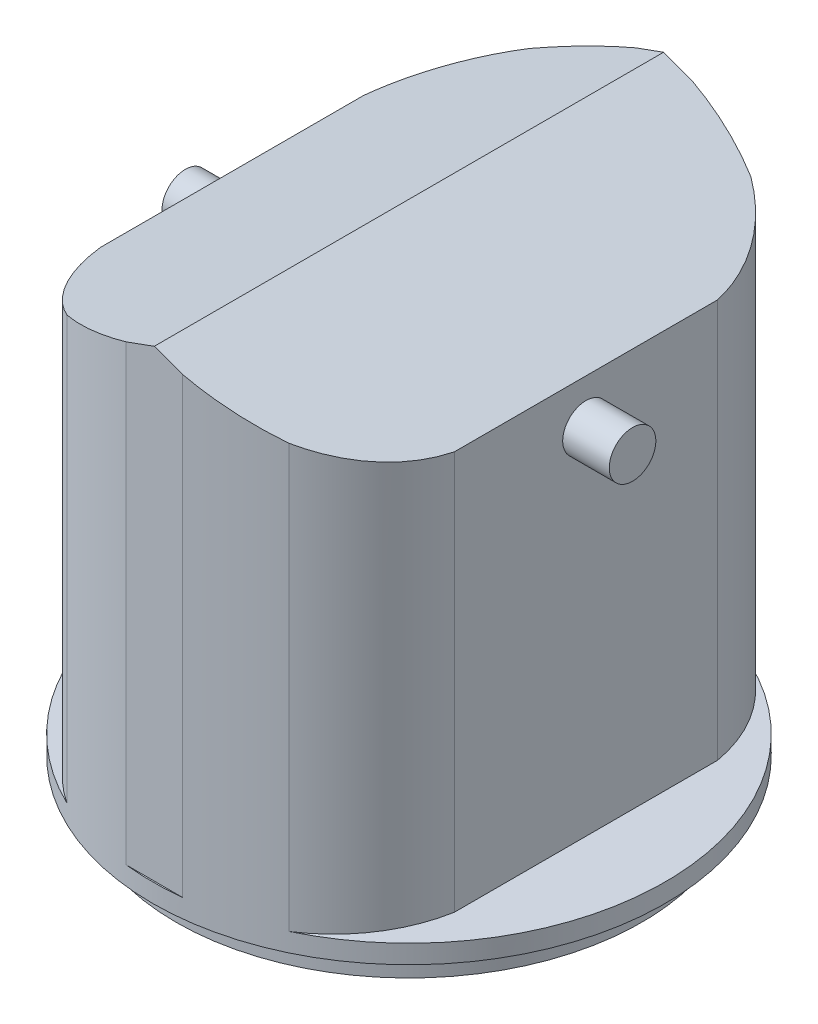
ISO-10303-21;
HEADER;
FILE_DESCRIPTION(('STEP AP214'),'2;1');
FILE_NAME('part.step','',(''),(''),'','','');
FILE_SCHEMA(('AUTOMOTIVE_DESIGN { 1 0 10303 214 1 1 1 1 }'));
ENDSEC;
DATA;
#1=APPLICATION_CONTEXT('core data for automotive mechanical design processes');
#2=APPLICATION_PROTOCOL_DEFINITION('international standard','automotive_design',2000,#1);
#3=PRODUCT_CONTEXT('',#1,'mechanical');
#4=PRODUCT('Part','Part','',(#3));
#5=PRODUCT_RELATED_PRODUCT_CATEGORY('part','',(#4));
#6=PRODUCT_DEFINITION_FORMATION('','',#4);
#7=PRODUCT_DEFINITION_CONTEXT('part definition',#1,'design');
#8=PRODUCT_DEFINITION('design','',#6,#7);
#9=PRODUCT_DEFINITION_SHAPE('','',#8);
#10=(LENGTH_UNIT() NAMED_UNIT(*) SI_UNIT(.MILLI.,.METRE.));
#11=(NAMED_UNIT(*) PLANE_ANGLE_UNIT() SI_UNIT($,.RADIAN.));
#12=(NAMED_UNIT(*) SI_UNIT($,.STERADIAN.) SOLID_ANGLE_UNIT());
#13=UNCERTAINTY_MEASURE_WITH_UNIT(LENGTH_MEASURE(1.E-05),#10,'distance_accuracy_value','');
#14=(GEOMETRIC_REPRESENTATION_CONTEXT(3) GLOBAL_UNCERTAINTY_ASSIGNED_CONTEXT((#13)) GLOBAL_UNIT_ASSIGNED_CONTEXT((#10,
#11,#12)) REPRESENTATION_CONTEXT('',''));
#15=CARTESIAN_POINT('',(0.,0.,0.));
#16=DIRECTION('',(0.,0.,1.));
#17=DIRECTION('',(1.,0.,0.));
#18=AXIS2_PLACEMENT_3D('',#15,#16,#17);
#19=CARTESIAN_POINT('',(0.,2.,0.));
#20=DIRECTION('',(0.,1.,0.));
#21=DIRECTION('',(0.,0.,1.));
#22=AXIS2_PLACEMENT_3D('',#19,#20,#21);
#23=PLANE('',#22);
#24=CARTESIAN_POINT('',(0.,2.,0.));
#25=DIRECTION('',(0.,1.,0.));
#26=DIRECTION('',(0.,0.,1.));
#27=AXIS2_PLACEMENT_3D('',#24,#25,#26);
#28=CIRCLE('',#27,27.5);
#29=CARTESIAN_POINT('',(-11.9035987749492,2.,-24.790206457491));
#30=VERTEX_POINT('',#29);
#31=CARTESIAN_POINT('',(-11.9035987749492,2.,24.790206457491));
#32=VERTEX_POINT('',#31);
#33=EDGE_CURVE('E146',#30,#32,#28,.T.);
#34=ORIENTED_EDGE('',*,*,#33,.T.);
#35=CARTESIAN_POINT('',(-3.24629308527923,2.,11.3346849813234));
#36=DIRECTION('',(0.,1.,0.));
#37=DIRECTION('',(0.,0.,1.));
#38=AXIS2_PLACEMENT_3D('',#35,#36,#37);
#39=CIRCLE('',#38,16.);
#40=CARTESIAN_POINT('',(-19.,2.,14.1312397269128));
#41=VERTEX_POINT('',#40);
#42=EDGE_CURVE('E155',#32,#41,#39,.F.);
#43=ORIENTED_EDGE('',*,*,#42,.T.);
#44=DIRECTION('',(0.,0.,1.));
#45=VECTOR('',#44,1.);
#46=CARTESIAN_POINT('',(-19.,2.,0.));
#47=LINE('',#46,#45);
#48=CARTESIAN_POINT('',(-19.,2.,-14.1312397269127));
#49=VERTEX_POINT('',#48);
#50=EDGE_CURVE('E242',#49,#41,#47,.T.);
#51=ORIENTED_EDGE('',*,*,#50,.F.);
#52=CARTESIAN_POINT('',(-3.24629308527922,2.,-11.3346849813234));
#53=DIRECTION('',(0.,1.,0.));
#54=DIRECTION('',(0.,0.,1.));
#55=AXIS2_PLACEMENT_3D('',#52,#53,#54);
#56=CIRCLE('',#55,16.);
#57=EDGE_CURVE('E167',#30,#49,#56,.T.);
#58=ORIENTED_EDGE('',*,*,#57,.F.);
#59=EDGE_LOOP('',(#34,#43,#51,#58));
#60=FACE_BOUND('',#59,.T.);
#61=ADVANCED_FACE('F43',(#60),#23,.T.);
#62=CARTESIAN_POINT('',(11.9035987749491,2.,24.7902064574911));
#63=VERTEX_POINT('',#62);
#64=CARTESIAN_POINT('',(11.9035987749492,2.,-24.790206457491));
#65=VERTEX_POINT('',#64);
#66=EDGE_CURVE('E175',#63,#65,#28,.T.);
#67=ORIENTED_EDGE('',*,*,#66,.T.);
#68=CARTESIAN_POINT('',(3.24629308527922,2.,-11.3346849813234));
#69=DIRECTION('',(0.,1.,0.));
#70=DIRECTION('',(0.,0.,1.));
#71=AXIS2_PLACEMENT_3D('',#68,#69,#70);
#72=CIRCLE('',#71,16.);
#73=CARTESIAN_POINT('',(19.,2.,-14.1312397269127));
#74=VERTEX_POINT('',#73);
#75=EDGE_CURVE('E349',#65,#74,#72,.F.);
#76=ORIENTED_EDGE('',*,*,#75,.T.);
#77=DIRECTION('',(0.,0.,1.));
#78=VECTOR('',#77,1.);
#79=CARTESIAN_POINT('',(19.,2.,0.));
#80=LINE('',#79,#78);
#81=CARTESIAN_POINT('',(19.,2.,14.1312397269126));
#82=VERTEX_POINT('',#81);
#83=EDGE_CURVE('E342',#74,#82,#80,.T.);
#84=ORIENTED_EDGE('',*,*,#83,.T.);
#85=CARTESIAN_POINT('',(3.24629308527921,2.,11.3346849813234));
#86=DIRECTION('',(0.,1.,0.));
#87=DIRECTION('',(0.,0.,1.));
#88=AXIS2_PLACEMENT_3D('',#85,#86,#87);
#89=CIRCLE('',#88,16.);
#90=EDGE_CURVE('E338',#63,#82,#89,.T.);
#91=ORIENTED_EDGE('',*,*,#90,.F.);
#92=EDGE_LOOP('',(#67,#76,#84,#91));
#93=FACE_BOUND('',#92,.T.);
#94=ADVANCED_FACE('F308',(#93),#23,.T.);
#95=CARTESIAN_POINT('',(-3.01081334058014,2.,27.3346849813234));
#96=VERTEX_POINT('',#95);
#97=CARTESIAN_POINT('',(3.01081334058014,2.,27.3346849813234));
#98=VERTEX_POINT('',#97);
#99=EDGE_CURVE('E170',#96,#98,#28,.T.);
#100=ORIENTED_EDGE('',*,*,#99,.T.);
#101=DIRECTION('',(-1.,0.,0.));
#102=VECTOR('',#101,1.);
#103=CARTESIAN_POINT('',(0.,2.,27.3346849813234));
#104=LINE('',#103,#102);
#105=EDGE_CURVE('E162',#98,#96,#104,.T.);
#106=ORIENTED_EDGE('',*,*,#105,.T.);
#107=EDGE_LOOP('',(#100,#106));
#108=FACE_BOUND('',#107,.T.);
#109=ADVANCED_FACE('F314',(#108),#23,.T.);
#110=CARTESIAN_POINT('',(0.,2.,0.));
#111=DIRECTION('',(0.,-1.,0.));
#112=DIRECTION('',(0.,0.,-1.));
#113=AXIS2_PLACEMENT_3D('',#110,#111,#112);
#114=CYLINDRICAL_SURFACE('',#113,27.5);
#115=DIRECTION('',(0.,-1.,0.));
#116=VECTOR('',#115,1.);
#117=CARTESIAN_POINT('',(11.9035987749491,52.8,24.7902064574911));
#118=LINE('',#117,#116);
#119=CARTESIAN_POINT('',(11.9035987749491,47.3828788163288,24.7902064574911));
#120=VERTEX_POINT('',#119);
#121=EDGE_CURVE('E274',#120,#63,#118,.T.);
#122=ORIENTED_EDGE('',*,*,#121,.F.);
#123=CARTESIAN_POINT('',(0.,51.7154344510578,0.));
#124=DIRECTION('',(-0.342020143325669,-0.939692620785908,0.));
#125=DIRECTION('',(0.939692620785908,-0.342020143325669,0.));
#126=AXIS2_PLACEMENT_3D('',#123,#124,#125);
#127=ELLIPSE('',#126,29.2648887430876,27.5);
#128=CARTESIAN_POINT('',(3.01081334058014,50.6195880141551,27.3346849813234));
#129=VERTEX_POINT('',#128);
#130=EDGE_CURVE('E204',#120,#129,#127,.T.);
#131=ORIENTED_EDGE('',*,*,#130,.T.);
#132=DIRECTION('',(0.,-1.,0.));
#133=VECTOR('',#132,1.);
#134=CARTESIAN_POINT('',(3.01081334058014,52.8,27.3346849813234));
#135=LINE('',#134,#133);
#136=EDGE_CURVE('E277',#129,#98,#135,.T.);
#137=ORIENTED_EDGE('',*,*,#136,.T.);
#138=ORIENTED_EDGE('',*,*,#99,.F.);
#139=DIRECTION('',(0.,-1.,0.));
#140=VECTOR('',#139,1.);
#141=CARTESIAN_POINT('',(-3.01081334058014,52.8,27.3346849813234));
#142=LINE('',#141,#140);
#143=CARTESIAN_POINT('',(-3.01081334058014,50.6195880141551,27.3346849813234));
#144=VERTEX_POINT('',#143);
#145=EDGE_CURVE('E152',#144,#96,#142,.T.);
#146=ORIENTED_EDGE('',*,*,#145,.F.);
#147=CARTESIAN_POINT('',(0.,51.7154344510579,0.));
#148=DIRECTION('',(-0.342020143325669,0.939692620785908,0.));
#149=DIRECTION('',(-0.939692620785908,-0.342020143325669,0.));
#150=AXIS2_PLACEMENT_3D('',#147,#148,#149);
#151=ELLIPSE('',#150,29.2648887430876,27.5);
#152=CARTESIAN_POINT('',(-11.9035987749492,47.3828788163287,24.790206457491));
#153=VERTEX_POINT('',#152);
#154=EDGE_CURVE('E149',#144,#153,#151,.F.);
#155=ORIENTED_EDGE('',*,*,#154,.T.);
#156=DIRECTION('',(0.,-1.,0.));
#157=VECTOR('',#156,1.);
#158=CARTESIAN_POINT('',(-11.9035987749492,52.8,24.790206457491));
#159=LINE('',#158,#157);
#160=EDGE_CURVE('E139',#153,#32,#159,.T.);
#161=ORIENTED_EDGE('',*,*,#160,.T.);
#162=ORIENTED_EDGE('',*,*,#33,.F.);
#163=DIRECTION('',(0.,-1.,0.));
#164=VECTOR('',#163,1.);
#165=CARTESIAN_POINT('',(-11.9035987749492,52.8,-24.790206457491));
#166=LINE('',#165,#164);
#167=CARTESIAN_POINT('',(-11.9035987749492,47.3828788163287,-24.790206457491));
#168=VERTEX_POINT('',#167);
#169=EDGE_CURVE('E252',#168,#30,#166,.T.);
#170=ORIENTED_EDGE('',*,*,#169,.F.);
#171=CARTESIAN_POINT('',(0.,51.7154344510579,0.));
#172=DIRECTION('',(-0.342020143325669,0.939692620785908,0.));
#173=DIRECTION('',(-0.939692620785908,-0.342020143325669,0.));
#174=AXIS2_PLACEMENT_3D('',#171,#172,#173);
#175=ELLIPSE('',#174,29.2648887430876,27.5);
#176=CARTESIAN_POINT('',(-3.01081334058014,50.6195880141551,-27.3346849813234));
#177=VERTEX_POINT('',#176);
#178=EDGE_CURVE('E196',#168,#177,#175,.F.);
#179=ORIENTED_EDGE('',*,*,#178,.T.);
#180=DIRECTION('',(0.,-1.,0.));
#181=VECTOR('',#180,1.);
#182=CARTESIAN_POINT('',(-3.01081334058014,52.8,-27.3346849813234));
#183=LINE('',#182,#181);
#184=CARTESIAN_POINT('',(-3.01081334058014,2.,-27.3346849813234));
#185=VERTEX_POINT('',#184);
#186=EDGE_CURVE('E255',#177,#185,#183,.T.);
#187=ORIENTED_EDGE('',*,*,#186,.T.);
#188=CARTESIAN_POINT('',(3.01081334058014,2.,-27.3346849813234));
#189=VERTEX_POINT('',#188);
#190=EDGE_CURVE('E169',#189,#185,#28,.T.);
#191=ORIENTED_EDGE('',*,*,#190,.F.);
#192=DIRECTION('',(0.,-1.,0.));
#193=VECTOR('',#192,1.);
#194=CARTESIAN_POINT('',(3.01081334058014,52.8,-27.3346849813234));
#195=LINE('',#194,#193);
#196=CARTESIAN_POINT('',(3.01081334058014,50.6195880141551,-27.3346849813234));
#197=VERTEX_POINT('',#196);
#198=EDGE_CURVE('E259',#197,#189,#195,.T.);
#199=ORIENTED_EDGE('',*,*,#198,.F.);
#200=CARTESIAN_POINT('',(0.,51.7154344510578,0.));
#201=DIRECTION('',(-0.342020143325669,-0.939692620785908,0.));
#202=DIRECTION('',(0.939692620785908,-0.342020143325669,0.));
#203=AXIS2_PLACEMENT_3D('',#200,#201,#202);
#204=ELLIPSE('',#203,29.2648887430876,27.5);
#205=CARTESIAN_POINT('',(11.9035987749492,47.3828788163287,-24.790206457491));
#206=VERTEX_POINT('',#205);
#207=EDGE_CURVE('E201',#197,#206,#204,.T.);
#208=ORIENTED_EDGE('',*,*,#207,.T.);
#209=DIRECTION('',(0.,-1.,0.));
#210=VECTOR('',#209,1.);
#211=CARTESIAN_POINT('',(11.9035987749492,52.8,-24.790206457491));
#212=LINE('',#211,#210);
#213=EDGE_CURVE('E265',#206,#65,#212,.T.);
#214=ORIENTED_EDGE('',*,*,#213,.T.);
#215=ORIENTED_EDGE('',*,*,#66,.F.);
#216=EDGE_LOOP('',(#122,#131,#137,#138,#146,#155,#161,#162,#170,#179,#187,#191,#199,#208,#214,#215));
#217=FACE_BOUND('',#216,.T.);
#218=CARTESIAN_POINT('',(0.,0.,0.));
#219=DIRECTION('',(0.,1.,0.));
#220=DIRECTION('',(0.,0.,1.));
#221=AXIS2_PLACEMENT_3D('',#218,#219,#220);
#222=CIRCLE('',#221,27.5);
#223=CARTESIAN_POINT('',(0.,0.,27.5));
#224=VERTEX_POINT('',#223);
#225=EDGE_CURVE('E177',#224,#224,#222,.T.);
#226=ORIENTED_EDGE('',*,*,#225,.T.);
#227=EDGE_LOOP('',(#226));
#228=FACE_BOUND('',#227,.T.);
#229=ADVANCED_FACE('F142',(#217,#228),#114,.T.);
#230=DIRECTION('',(-1.,0.,0.));
#231=VECTOR('',#230,1.);
#232=CARTESIAN_POINT('',(0.,2.,-27.3346849813234));
#233=LINE('',#232,#231);
#234=EDGE_CURVE('E353',#189,#185,#233,.T.);
#235=ORIENTED_EDGE('',*,*,#234,.F.);
#236=ORIENTED_EDGE('',*,*,#190,.T.);
#237=EDGE_LOOP('',(#235,#236));
#238=FACE_BOUND('',#237,.T.);
#239=ADVANCED_FACE('F310',(#238),#23,.T.);
#240=CARTESIAN_POINT('',(0.,0.,0.));
#241=DIRECTION('',(0.,1.,0.));
#242=DIRECTION('',(0.,0.,1.));
#243=AXIS2_PLACEMENT_3D('',#240,#241,#242);
#244=PLANE('',#243);
#245=CARTESIAN_POINT('',(0.,0.,0.));
#246=DIRECTION('',(0.,1.,0.));
#247=DIRECTION('',(0.,0.,1.));
#248=AXIS2_PLACEMENT_3D('',#245,#246,#247);
#249=CIRCLE('',#248,25.);
#250=CARTESIAN_POINT('',(0.,0.,25.));
#251=VERTEX_POINT('',#250);
#252=EDGE_CURVE('E185',#251,#251,#249,.F.);
#253=ORIENTED_EDGE('',*,*,#252,.F.);
#254=EDGE_LOOP('',(#253));
#255=FACE_BOUND('',#254,.T.);
#256=ORIENTED_EDGE('',*,*,#225,.F.);
#257=EDGE_LOOP('',(#256));
#258=FACE_BOUND('',#257,.T.);
#259=ADVANCED_FACE('F301',(#255,#258),#244,.F.);
#260=CARTESIAN_POINT('',(0.,-3.,0.));
#261=DIRECTION('',(0.,-1.,0.));
#262=DIRECTION('',(0.,0.,-1.));
#263=AXIS2_PLACEMENT_3D('',#260,#261,#262);
#264=PLANE('',#263);
#265=CARTESIAN_POINT('',(0.,-3.,0.));
#266=DIRECTION('',(0.,-1.,0.));
#267=DIRECTION('',(0.,0.,-1.));
#268=AXIS2_PLACEMENT_3D('',#265,#266,#267);
#269=CIRCLE('',#268,25.);
#270=CARTESIAN_POINT('',(0.,-3.,-25.));
#271=VERTEX_POINT('',#270);
#272=EDGE_CURVE('E180',#271,#271,#269,.T.);
#273=ORIENTED_EDGE('',*,*,#272,.T.);
#274=EDGE_LOOP('',(#273));
#275=FACE_BOUND('',#274,.T.);
#276=CARTESIAN_POINT('',(0.,-3.,0.));
#277=DIRECTION('',(0.,-1.,0.));
#278=DIRECTION('',(0.,0.,-1.));
#279=AXIS2_PLACEMENT_3D('',#276,#277,#278);
#280=CIRCLE('',#279,23.);
#281=CARTESIAN_POINT('',(0.,-3.,-23.));
#282=VERTEX_POINT('',#281);
#283=EDGE_CURVE('E282',#282,#282,#280,.T.);
#284=ORIENTED_EDGE('',*,*,#283,.F.);
#285=EDGE_LOOP('',(#284));
#286=FACE_BOUND('',#285,.T.);
#287=ADVANCED_FACE('F302',(#275,#286),#264,.T.);
#288=CARTESIAN_POINT('',(0.,-3.,0.));
#289=DIRECTION('',(0.,1.,0.));
#290=DIRECTION('',(0.,0.,1.));
#291=AXIS2_PLACEMENT_3D('',#288,#289,#290);
#292=CYLINDRICAL_SURFACE('',#291,25.);
#293=ORIENTED_EDGE('',*,*,#272,.F.);
#294=EDGE_LOOP('',(#293));
#295=FACE_BOUND('',#294,.T.);
#296=ORIENTED_EDGE('',*,*,#252,.T.);
#297=EDGE_LOOP('',(#296));
#298=FACE_BOUND('',#297,.T.);
#299=ADVANCED_FACE('F293',(#295,#298),#292,.T.);
#300=CARTESIAN_POINT('',(0.,-3.,0.));
#301=DIRECTION('',(0.,1.,0.));
#302=DIRECTION('',(0.,0.,1.));
#303=AXIS2_PLACEMENT_3D('',#300,#301,#302);
#304=CYLINDRICAL_SURFACE('',#303,23.);
#305=ORIENTED_EDGE('',*,*,#283,.T.);
#306=EDGE_LOOP('',(#305));
#307=FACE_BOUND('',#306,.T.);
#308=CARTESIAN_POINT('',(0.,0.,0.));
#309=DIRECTION('',(0.,-1.,0.));
#310=DIRECTION('',(0.,0.,-1.));
#311=AXIS2_PLACEMENT_3D('',#308,#309,#310);
#312=CIRCLE('',#311,23.);
#313=CARTESIAN_POINT('',(0.,0.,-23.));
#314=VERTEX_POINT('',#313);
#315=EDGE_CURVE('E151',#314,#314,#312,.T.);
#316=ORIENTED_EDGE('',*,*,#315,.F.);
#317=EDGE_LOOP('',(#316));
#318=FACE_BOUND('',#317,.T.);
#319=ADVANCED_FACE('F291',(#307,#318),#304,.F.);
#320=ORIENTED_EDGE('',*,*,#315,.T.);
#321=EDGE_LOOP('',(#320));
#322=FACE_BOUND('',#321,.T.);
#323=ADVANCED_FACE('F289',(#322),#244,.F.);
#324=CARTESIAN_POINT('',(-3.24629308527923,52.8,11.3346849813234));
#325=DIRECTION('',(0.,-1.,0.));
#326=DIRECTION('',(0.,0.,-1.));
#327=AXIS2_PLACEMENT_3D('',#324,#325,#326);
#328=CYLINDRICAL_SURFACE('',#327,16.);
#329=ORIENTED_EDGE('',*,*,#160,.F.);
#330=CARTESIAN_POINT('',(-3.24629308527923,50.533880396312,11.3346849813234));
#331=DIRECTION('',(-0.342020143325669,0.939692620785908,0.));
#332=DIRECTION('',(-0.939692620785908,-0.342020143325669,0.));
#333=AXIS2_PLACEMENT_3D('',#330,#331,#332);
#334=ELLIPSE('',#333,17.0268443596146,16.);
#335=CARTESIAN_POINT('',(-19.,44.8,14.1312397269128));
#336=VERTEX_POINT('',#335);
#337=EDGE_CURVE('E67',#153,#336,#334,.F.);
#338=ORIENTED_EDGE('',*,*,#337,.T.);
#339=DIRECTION('',(0.,-1.,0.));
#340=VECTOR('',#339,1.);
#341=CARTESIAN_POINT('',(-19.,52.8,14.1312397269128));
#342=LINE('',#341,#340);
#343=EDGE_CURVE('E157',#336,#41,#342,.T.);
#344=ORIENTED_EDGE('',*,*,#343,.T.);
#345=ORIENTED_EDGE('',*,*,#42,.F.);
#346=EDGE_LOOP('',(#329,#338,#344,#345));
#347=FACE_BOUND('',#346,.T.);
#348=ADVANCED_FACE('F156',(#347),#328,.T.);
#349=CARTESIAN_POINT('',(0.,52.8,27.3346849813234));
#350=DIRECTION('',(0.,0.,1.));
#351=DIRECTION('',(1.,0.,0.));
#352=AXIS2_PLACEMENT_3D('',#349,#350,#351);
#353=PLANE('',#352);
#354=ORIENTED_EDGE('',*,*,#136,.F.);
#355=DIRECTION('',(0.939692620785908,-0.342020143325669,0.));
#356=VECTOR('',#355,1.);
#357=CARTESIAN_POINT('',(-0.348572648376447,51.8423045195462,27.3346849813234));
#358=LINE('',#357,#356);
#359=CARTESIAN_POINT('',(0.,51.7154344510579,27.3346849813234));
#360=VERTEX_POINT('',#359);
#361=EDGE_CURVE('E210',#129,#360,#358,.F.);
#362=ORIENTED_EDGE('',*,*,#361,.T.);
#363=DIRECTION('',(-0.939692620785908,-0.342020143325669,0.));
#364=VECTOR('',#363,1.);
#365=CARTESIAN_POINT('',(0.348572648376446,51.8423045195462,27.3346849813234));
#366=LINE('',#365,#364);
#367=EDGE_CURVE('E207',#360,#144,#366,.T.);
#368=ORIENTED_EDGE('',*,*,#367,.T.);
#369=ORIENTED_EDGE('',*,*,#145,.T.);
#370=ORIENTED_EDGE('',*,*,#105,.F.);
#371=EDGE_LOOP('',(#354,#362,#368,#369,#370));
#372=FACE_BOUND('',#371,.T.);
#373=ADVANCED_FACE('F336',(#372),#353,.T.);
#374=CARTESIAN_POINT('',(3.24629308527921,52.8,11.3346849813234));
#375=DIRECTION('',(0.,-1.,0.));
#376=DIRECTION('',(0.,0.,-1.));
#377=AXIS2_PLACEMENT_3D('',#374,#375,#376);
#378=CYLINDRICAL_SURFACE('',#377,16.);
#379=DIRECTION('',(0.,-1.,0.));
#380=VECTOR('',#379,1.);
#381=CARTESIAN_POINT('',(19.,52.8,14.1312397269126));
#382=LINE('',#381,#380);
#383=CARTESIAN_POINT('',(19.,44.8,14.1312397269126));
#384=VERTEX_POINT('',#383);
#385=EDGE_CURVE('E271',#384,#82,#382,.T.);
#386=ORIENTED_EDGE('',*,*,#385,.F.);
#387=CARTESIAN_POINT('',(3.24629308527921,50.533880396312,11.3346849813234));
#388=DIRECTION('',(-0.342020143325669,-0.939692620785908,0.));
#389=DIRECTION('',(0.939692620785908,-0.342020143325669,0.));
#390=AXIS2_PLACEMENT_3D('',#387,#388,#389);
#391=ELLIPSE('',#390,17.0268443596146,16.);
#392=EDGE_CURVE('E193',#384,#120,#391,.T.);
#393=ORIENTED_EDGE('',*,*,#392,.T.);
#394=ORIENTED_EDGE('',*,*,#121,.T.);
#395=ORIENTED_EDGE('',*,*,#90,.T.);
#396=EDGE_LOOP('',(#386,#393,#394,#395));
#397=FACE_BOUND('',#396,.T.);
#398=ADVANCED_FACE('F385',(#397),#378,.T.);
#399=CARTESIAN_POINT('',(19.,52.8,0.));
#400=DIRECTION('',(1.,0.,0.));
#401=DIRECTION('',(0.,0.,-1.));
#402=AXIS2_PLACEMENT_3D('',#399,#400,#401);
#403=PLANE('',#402);
#404=CARTESIAN_POINT('',(19.,40.,0.));
#405=DIRECTION('',(1.,0.,0.));
#406=DIRECTION('',(0.,0.,-1.));
#407=AXIS2_PLACEMENT_3D('',#404,#405,#406);
#408=CIRCLE('',#407,2.5);
#409=CARTESIAN_POINT('',(19.,40.,-2.5));
#410=VERTEX_POINT('',#409);
#411=EDGE_CURVE('E11',#410,#410,#408,.T.);
#412=ORIENTED_EDGE('',*,*,#411,.F.);
#413=EDGE_LOOP('',(#412));
#414=FACE_BOUND('',#413,.T.);
#415=DIRECTION('',(0.,-1.,0.));
#416=VECTOR('',#415,1.);
#417=CARTESIAN_POINT('',(19.,52.8,-14.1312397269127));
#418=LINE('',#417,#416);
#419=CARTESIAN_POINT('',(19.,44.8,-14.1312397269127));
#420=VERTEX_POINT('',#419);
#421=EDGE_CURVE('E268',#420,#74,#418,.T.);
#422=ORIENTED_EDGE('',*,*,#421,.F.);
#423=DIRECTION('',(0.,0.,1.));
#424=VECTOR('',#423,1.);
#425=CARTESIAN_POINT('',(19.,44.8,0.));
#426=LINE('',#425,#424);
#427=EDGE_CURVE('E189',#420,#384,#426,.T.);
#428=ORIENTED_EDGE('',*,*,#427,.T.);
#429=ORIENTED_EDGE('',*,*,#385,.T.);
#430=ORIENTED_EDGE('',*,*,#83,.F.);
#431=EDGE_LOOP('',(#422,#428,#429,#430));
#432=FACE_BOUND('',#431,.T.);
#433=ADVANCED_FACE('F377',(#414,#432),#403,.T.);
#434=CARTESIAN_POINT('',(3.24629308527922,52.8,-11.3346849813234));
#435=DIRECTION('',(0.,-1.,0.));
#436=DIRECTION('',(0.,0.,-1.));
#437=AXIS2_PLACEMENT_3D('',#434,#435,#436);
#438=CYLINDRICAL_SURFACE('',#437,16.);
#439=ORIENTED_EDGE('',*,*,#213,.F.);
#440=CARTESIAN_POINT('',(3.24629308527922,50.533880396312,-11.3346849813234));
#441=DIRECTION('',(-0.342020143325669,-0.939692620785908,0.));
#442=DIRECTION('',(0.939692620785908,-0.342020143325669,0.));
#443=AXIS2_PLACEMENT_3D('',#440,#441,#442);
#444=ELLIPSE('',#443,17.0268443596146,16.);
#445=EDGE_CURVE('E219',#206,#420,#444,.T.);
#446=ORIENTED_EDGE('',*,*,#445,.T.);
#447=ORIENTED_EDGE('',*,*,#421,.T.);
#448=ORIENTED_EDGE('',*,*,#75,.F.);
#449=EDGE_LOOP('',(#439,#446,#447,#448));
#450=FACE_BOUND('',#449,.T.);
#451=ADVANCED_FACE('F373',(#450),#438,.T.);
#452=CARTESIAN_POINT('',(0.,52.8,-27.3346849813234));
#453=DIRECTION('',(0.,0.,1.));
#454=DIRECTION('',(1.,0.,0.));
#455=AXIS2_PLACEMENT_3D('',#452,#453,#454);
#456=PLANE('',#455);
#457=DIRECTION('',(0.939692620785908,0.342020143325669,0.));
#458=VECTOR('',#457,1.);
#459=CARTESIAN_POINT('',(2.97981935563694,52.8,-27.3346849813234));
#460=LINE('',#459,#458);
#461=CARTESIAN_POINT('',(0.,51.7154344510579,-27.3346849813234));
#462=VERTEX_POINT('',#461);
#463=EDGE_CURVE('E213',#177,#462,#460,.T.);
#464=ORIENTED_EDGE('',*,*,#463,.T.);
#465=DIRECTION('',(-0.939692620785908,0.342020143325669,0.));
#466=VECTOR('',#465,1.);
#467=CARTESIAN_POINT('',(19.,44.8,-27.3346849813234));
#468=LINE('',#467,#466);
#469=EDGE_CURVE('E216',#462,#197,#468,.F.);
#470=ORIENTED_EDGE('',*,*,#469,.T.);
#471=ORIENTED_EDGE('',*,*,#198,.T.);
#472=ORIENTED_EDGE('',*,*,#234,.T.);
#473=ORIENTED_EDGE('',*,*,#186,.F.);
#474=EDGE_LOOP('',(#464,#470,#471,#472,#473));
#475=FACE_BOUND('',#474,.T.);
#476=ADVANCED_FACE('F361',(#475),#456,.F.);
#477=CARTESIAN_POINT('',(-3.24629308527922,52.8,-11.3346849813234));
#478=DIRECTION('',(0.,-1.,0.));
#479=DIRECTION('',(0.,0.,-1.));
#480=AXIS2_PLACEMENT_3D('',#477,#478,#479);
#481=CYLINDRICAL_SURFACE('',#480,16.);
#482=DIRECTION('',(0.,-1.,0.));
#483=VECTOR('',#482,1.);
#484=CARTESIAN_POINT('',(-19.,52.8,-14.1312397269127));
#485=LINE('',#484,#483);
#486=CARTESIAN_POINT('',(-19.,44.8,-14.1312397269127));
#487=VERTEX_POINT('',#486);
#488=EDGE_CURVE('E244',#487,#49,#485,.T.);
#489=ORIENTED_EDGE('',*,*,#488,.F.);
#490=CARTESIAN_POINT('',(-3.24629308527922,50.533880396312,-11.3346849813234));
#491=DIRECTION('',(-0.342020143325669,0.939692620785908,0.));
#492=DIRECTION('',(-0.939692620785908,-0.342020143325669,0.));
#493=AXIS2_PLACEMENT_3D('',#490,#491,#492);
#494=ELLIPSE('',#493,17.0268443596146,16.);
#495=EDGE_CURVE('E226',#487,#168,#494,.F.);
#496=ORIENTED_EDGE('',*,*,#495,.T.);
#497=ORIENTED_EDGE('',*,*,#169,.T.);
#498=ORIENTED_EDGE('',*,*,#57,.T.);
#499=EDGE_LOOP('',(#489,#496,#497,#498));
#500=FACE_BOUND('',#499,.T.);
#501=ADVANCED_FACE('F240',(#500),#481,.T.);
#502=CARTESIAN_POINT('',(-19.,52.8,0.));
#503=DIRECTION('',(1.,0.,0.));
#504=DIRECTION('',(0.,0.,-1.));
#505=AXIS2_PLACEMENT_3D('',#502,#503,#504);
#506=PLANE('',#505);
#507=CARTESIAN_POINT('',(-19.,40.,0.));
#508=DIRECTION('',(1.,0.,0.));
#509=DIRECTION('',(0.,0.,-1.));
#510=AXIS2_PLACEMENT_3D('',#507,#508,#509);
#511=CIRCLE('',#510,2.5);
#512=CARTESIAN_POINT('',(-19.,40.,-2.5));
#513=VERTEX_POINT('',#512);
#514=EDGE_CURVE('E52',#513,#513,#511,.F.);
#515=ORIENTED_EDGE('',*,*,#514,.F.);
#516=EDGE_LOOP('',(#515));
#517=FACE_BOUND('',#516,.T.);
#518=ORIENTED_EDGE('',*,*,#343,.F.);
#519=DIRECTION('',(0.,0.,-1.));
#520=VECTOR('',#519,1.);
#521=CARTESIAN_POINT('',(-19.,44.8,-14.1312397269127));
#522=LINE('',#521,#520);
#523=EDGE_CURVE('E59',#336,#487,#522,.T.);
#524=ORIENTED_EDGE('',*,*,#523,.T.);
#525=ORIENTED_EDGE('',*,*,#488,.T.);
#526=ORIENTED_EDGE('',*,*,#50,.T.);
#527=EDGE_LOOP('',(#518,#524,#525,#526));
#528=FACE_BOUND('',#527,.T.);
#529=ADVANCED_FACE('F238',(#517,#528),#506,.F.);
#530=CARTESIAN_POINT('',(2.97981935563694,52.8,0.));
#531=DIRECTION('',(-0.342020143325669,0.939692620785908,0.));
#532=DIRECTION('',(0.,0.,-1.));
#533=AXIS2_PLACEMENT_3D('',#530,#531,#532);
#534=PLANE('',#533);
#535=DIRECTION('',(0.,0.,-1.));
#536=VECTOR('',#535,1.);
#537=CARTESIAN_POINT('',(0.,51.7154344510579,0.));
#538=LINE('',#537,#536);
#539=EDGE_CURVE('E163',#462,#360,#538,.F.);
#540=ORIENTED_EDGE('',*,*,#539,.F.);
#541=ORIENTED_EDGE('',*,*,#463,.F.);
#542=ORIENTED_EDGE('',*,*,#178,.F.);
#543=ORIENTED_EDGE('',*,*,#495,.F.);
#544=ORIENTED_EDGE('',*,*,#523,.F.);
#545=ORIENTED_EDGE('',*,*,#337,.F.);
#546=ORIENTED_EDGE('',*,*,#154,.F.);
#547=ORIENTED_EDGE('',*,*,#367,.F.);
#548=EDGE_LOOP('',(#540,#541,#542,#543,#544,#545,#546,#547));
#549=FACE_BOUND('',#548,.T.);
#550=ADVANCED_FACE('F45',(#549),#534,.T.);
#551=CARTESIAN_POINT('',(19.,44.8,0.));
#552=DIRECTION('',(-0.342020143325669,-0.939692620785908,0.));
#553=DIRECTION('',(0.,0.,1.));
#554=AXIS2_PLACEMENT_3D('',#551,#552,#553);
#555=PLANE('',#554);
#556=ORIENTED_EDGE('',*,*,#469,.F.);
#557=ORIENTED_EDGE('',*,*,#539,.T.);
#558=ORIENTED_EDGE('',*,*,#361,.F.);
#559=ORIENTED_EDGE('',*,*,#130,.F.);
#560=ORIENTED_EDGE('',*,*,#392,.F.);
#561=ORIENTED_EDGE('',*,*,#427,.F.);
#562=ORIENTED_EDGE('',*,*,#445,.F.);
#563=ORIENTED_EDGE('',*,*,#207,.F.);
#564=EDGE_LOOP('',(#556,#557,#558,#559,#560,#561,#562,#563));
#565=FACE_BOUND('',#564,.T.);
#566=ADVANCED_FACE('F369',(#565),#555,.F.);
#567=CARTESIAN_POINT('',(-24.,40.,0.));
#568=DIRECTION('',(1.,0.,0.));
#569=DIRECTION('',(0.,0.,-1.));
#570=AXIS2_PLACEMENT_3D('',#567,#568,#569);
#571=CYLINDRICAL_SURFACE('',#570,2.5);
#572=CARTESIAN_POINT('',(-24.,40.,0.));
#573=DIRECTION('',(-1.,0.,0.));
#574=DIRECTION('',(0.,0.,1.));
#575=AXIS2_PLACEMENT_3D('',#572,#573,#574);
#576=CIRCLE('',#575,2.5);
#577=CARTESIAN_POINT('',(-24.,40.,2.5));
#578=VERTEX_POINT('',#577);
#579=EDGE_CURVE('E231',#578,#578,#576,.T.);
#580=ORIENTED_EDGE('',*,*,#579,.F.);
#581=EDGE_LOOP('',(#580));
#582=FACE_BOUND('',#581,.T.);
#583=ORIENTED_EDGE('',*,*,#514,.T.);
#584=EDGE_LOOP('',(#583));
#585=FACE_BOUND('',#584,.T.);
#586=ADVANCED_FACE('F236',(#582,#585),#571,.T.);
#587=CARTESIAN_POINT('',(-24.,40.,0.));
#588=DIRECTION('',(-1.,0.,0.));
#589=DIRECTION('',(0.,0.,1.));
#590=AXIS2_PLACEMENT_3D('',#587,#588,#589);
#591=PLANE('',#590);
#592=ORIENTED_EDGE('',*,*,#579,.T.);
#593=EDGE_LOOP('',(#592));
#594=FACE_BOUND('',#593,.T.);
#595=ADVANCED_FACE('F462',(#594),#591,.T.);
#596=CARTESIAN_POINT('',(24.,40.,0.));
#597=DIRECTION('',(-1.,0.,0.));
#598=DIRECTION('',(0.,0.,1.));
#599=AXIS2_PLACEMENT_3D('',#596,#597,#598);
#600=CYLINDRICAL_SURFACE('',#599,2.5);
#601=CARTESIAN_POINT('',(24.,40.,0.));
#602=DIRECTION('',(-1.,0.,0.));
#603=DIRECTION('',(0.,0.,1.));
#604=AXIS2_PLACEMENT_3D('',#601,#602,#603);
#605=CIRCLE('',#604,2.5);
#606=CARTESIAN_POINT('',(24.,40.,2.5));
#607=VERTEX_POINT('',#606);
#608=EDGE_CURVE('E500',#607,#607,#605,.T.);
#609=ORIENTED_EDGE('',*,*,#608,.T.);
#610=EDGE_LOOP('',(#609));
#611=FACE_BOUND('',#610,.T.);
#612=ORIENTED_EDGE('',*,*,#411,.T.);
#613=EDGE_LOOP('',(#612));
#614=FACE_BOUND('',#613,.T.);
#615=ADVANCED_FACE('F471',(#611,#614),#600,.T.);
#616=CARTESIAN_POINT('',(24.,40.,0.));
#617=DIRECTION('',(1.,0.,0.));
#618=DIRECTION('',(0.,0.,1.));
#619=AXIS2_PLACEMENT_3D('',#616,#617,#618);
#620=PLANE('',#619);
#621=ORIENTED_EDGE('',*,*,#608,.F.);
#622=EDGE_LOOP('',(#621));
#623=FACE_BOUND('',#622,.T.);
#624=ADVANCED_FACE('F484',(#623),#620,.T.);
#625=CLOSED_SHELL('',(#61,#94,#109,#229,#239,#259,#287,#299,#319,#323,#348,#373,#398,#433,#451,
#476,#501,#529,#550,#566,#586,#595,#615,#624));
#626=MANIFOLD_SOLID_BREP('B2',#625);
#627=ADVANCED_BREP_SHAPE_REPRESENTATION('',(#18,#626),#14);
#628=SHAPE_DEFINITION_REPRESENTATION(#9,#627);
ENDSEC;
END-ISO-10303-21;
